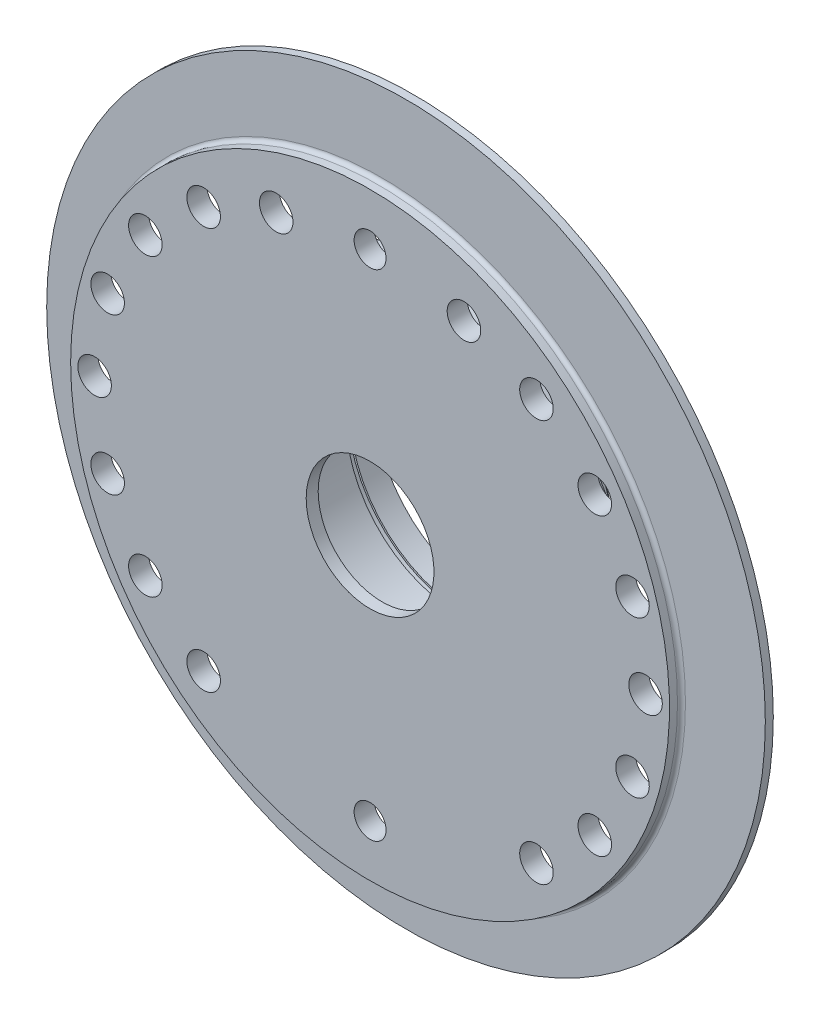
ISO-10303-21;
HEADER;
FILE_DESCRIPTION(('STEP AP214'),'2;1');
FILE_NAME('part.step','',(''),(''),'','','');
FILE_SCHEMA(('AUTOMOTIVE_DESIGN { 1 0 10303 214 1 1 1 1 }'));
ENDSEC;
DATA;
#1=APPLICATION_CONTEXT('core data for automotive mechanical design processes');
#2=APPLICATION_PROTOCOL_DEFINITION('international standard','automotive_design',2000,#1);
#3=PRODUCT_CONTEXT('',#1,'mechanical');
#4=PRODUCT('Part','Part','',(#3));
#5=PRODUCT_RELATED_PRODUCT_CATEGORY('part','',(#4));
#6=PRODUCT_DEFINITION_FORMATION('','',#4);
#7=PRODUCT_DEFINITION_CONTEXT('part definition',#1,'design');
#8=PRODUCT_DEFINITION('design','',#6,#7);
#9=PRODUCT_DEFINITION_SHAPE('','',#8);
#10=(LENGTH_UNIT() NAMED_UNIT(*) SI_UNIT(.MILLI.,.METRE.));
#11=(NAMED_UNIT(*) PLANE_ANGLE_UNIT() SI_UNIT($,.RADIAN.));
#12=(NAMED_UNIT(*) SI_UNIT($,.STERADIAN.) SOLID_ANGLE_UNIT());
#13=UNCERTAINTY_MEASURE_WITH_UNIT(LENGTH_MEASURE(1.E-05),#10,'distance_accuracy_value','');
#14=(GEOMETRIC_REPRESENTATION_CONTEXT(3) GLOBAL_UNCERTAINTY_ASSIGNED_CONTEXT((#13)) GLOBAL_UNIT_ASSIGNED_CONTEXT((#10,
#11,#12)) REPRESENTATION_CONTEXT('',''));
#15=CARTESIAN_POINT('',(0.,0.,0.));
#16=DIRECTION('',(0.,0.,1.));
#17=DIRECTION('',(1.,0.,0.));
#18=AXIS2_PLACEMENT_3D('',#15,#16,#17);
#19=CARTESIAN_POINT('',(0.,14.5,-10.5));
#20=DIRECTION('',(0.,0.,-1.));
#21=DIRECTION('',(-1.,0.,0.));
#22=AXIS2_PLACEMENT_3D('',#19,#20,#21);
#23=PLANE('',#22);
#24=CARTESIAN_POINT('',(0.,0.,-10.5));
#25=DIRECTION('',(0.,0.,-1.));
#26=DIRECTION('',(-1.,0.,0.));
#27=AXIS2_PLACEMENT_3D('',#24,#25,#26);
#28=CIRCLE('',#27,14.75);
#29=CARTESIAN_POINT('',(-14.75,0.,-10.5));
#30=VERTEX_POINT('',#29);
#31=EDGE_CURVE('E96',#30,#30,#28,.T.);
#32=ORIENTED_EDGE('',*,*,#31,.F.);
#33=EDGE_LOOP('',(#32));
#34=FACE_BOUND('',#33,.T.);
#35=CARTESIAN_POINT('',(0.,0.,-10.5));
#36=DIRECTION('',(0.,0.,-1.));
#37=DIRECTION('',(-1.,0.,0.));
#38=AXIS2_PLACEMENT_3D('',#35,#36,#37);
#39=CIRCLE('',#38,14.5);
#40=CARTESIAN_POINT('',(-14.5,0.,-10.5));
#41=VERTEX_POINT('',#40);
#42=EDGE_CURVE('E93',#41,#41,#39,.T.);
#43=ORIENTED_EDGE('',*,*,#42,.T.);
#44=EDGE_LOOP('',(#43));
#45=FACE_BOUND('',#44,.T.);
#46=ADVANCED_FACE('F36',(#34,#45),#23,.F.);
#47=CARTESIAN_POINT('',(0.,0.,1.5));
#48=DIRECTION('',(0.,0.,-1.));
#49=DIRECTION('',(-1.,0.,0.));
#50=AXIS2_PLACEMENT_3D('',#47,#48,#49);
#51=CYLINDRICAL_SURFACE('',#50,14.75);
#52=CARTESIAN_POINT('',(0.,0.,-9.5));
#53=DIRECTION('',(0.,0.,-1.));
#54=DIRECTION('',(-1.,0.,0.));
#55=AXIS2_PLACEMENT_3D('',#52,#53,#54);
#56=CIRCLE('',#55,14.75);
#57=CARTESIAN_POINT('',(-14.75,0.,-9.5));
#58=VERTEX_POINT('',#57);
#59=EDGE_CURVE('E99',#58,#58,#56,.T.);
#60=ORIENTED_EDGE('',*,*,#59,.F.);
#61=EDGE_LOOP('',(#60));
#62=FACE_BOUND('',#61,.T.);
#63=ORIENTED_EDGE('',*,*,#31,.T.);
#64=EDGE_LOOP('',(#63));
#65=FACE_BOUND('',#64,.T.);
#66=ADVANCED_FACE('F241',(#62,#65),#51,.F.);
#67=CARTESIAN_POINT('',(0.,0.,1.5));
#68=DIRECTION('',(0.,0.,-1.));
#69=DIRECTION('',(-1.,0.,0.));
#70=AXIS2_PLACEMENT_3D('',#67,#68,#69);
#71=CYLINDRICAL_SURFACE('',#70,14.5);
#72=ORIENTED_EDGE('',*,*,#42,.F.);
#73=EDGE_LOOP('',(#72));
#74=FACE_BOUND('',#73,.T.);
#75=CARTESIAN_POINT('',(0.,0.,-13.5));
#76=DIRECTION('',(0.,0.,-1.));
#77=DIRECTION('',(-1.,0.,0.));
#78=AXIS2_PLACEMENT_3D('',#75,#76,#77);
#79=CIRCLE('',#78,14.5);
#80=CARTESIAN_POINT('',(-14.5,0.,-13.5));
#81=VERTEX_POINT('',#80);
#82=EDGE_CURVE('E90',#81,#81,#79,.T.);
#83=ORIENTED_EDGE('',*,*,#82,.T.);
#84=EDGE_LOOP('',(#83));
#85=FACE_BOUND('',#84,.T.);
#86=ADVANCED_FACE('F247',(#74,#85),#71,.F.);
#87=CARTESIAN_POINT('',(0.,14.75,-9.5));
#88=DIRECTION('',(0.,0.,1.));
#89=DIRECTION('',(1.,0.,0.));
#90=AXIS2_PLACEMENT_3D('',#87,#88,#89);
#91=PLANE('',#90);
#92=CARTESIAN_POINT('',(0.,0.,-9.5));
#93=DIRECTION('',(0.,0.,-1.));
#94=DIRECTION('',(-1.,0.,0.));
#95=AXIS2_PLACEMENT_3D('',#92,#93,#94);
#96=CIRCLE('',#95,14.);
#97=CARTESIAN_POINT('',(-14.,0.,-9.5));
#98=VERTEX_POINT('',#97);
#99=EDGE_CURVE('E102',#98,#98,#96,.T.);
#100=ORIENTED_EDGE('',*,*,#99,.F.);
#101=EDGE_LOOP('',(#100));
#102=FACE_BOUND('',#101,.T.);
#103=ORIENTED_EDGE('',*,*,#59,.T.);
#104=EDGE_LOOP('',(#103));
#105=FACE_BOUND('',#104,.T.);
#106=ADVANCED_FACE('F256',(#102,#105),#91,.F.);
#107=CARTESIAN_POINT('',(0.,16.,-13.5));
#108=DIRECTION('',(0.,0.,1.));
#109=DIRECTION('',(1.,0.,0.));
#110=AXIS2_PLACEMENT_3D('',#107,#108,#109);
#111=PLANE('',#110);
#112=CARTESIAN_POINT('',(0.,0.,-13.5));
#113=DIRECTION('',(0.,0.,1.));
#114=DIRECTION('',(1.,0.,0.));
#115=AXIS2_PLACEMENT_3D('',#112,#113,#114);
#116=CIRCLE('',#115,15.5);
#117=CARTESIAN_POINT('',(15.5,0.,-13.5));
#118=VERTEX_POINT('',#117);
#119=EDGE_CURVE('E51',#118,#118,#116,.F.);
#120=ORIENTED_EDGE('',*,*,#119,.T.);
#121=EDGE_LOOP('',(#120));
#122=FACE_BOUND('',#121,.T.);
#123=ORIENTED_EDGE('',*,*,#82,.F.);
#124=EDGE_LOOP('',(#123));
#125=FACE_BOUND('',#124,.T.);
#126=ADVANCED_FACE('F258',(#122,#125),#111,.F.);
#127=CARTESIAN_POINT('',(0.,0.,1.5));
#128=DIRECTION('',(0.,0.,-1.));
#129=DIRECTION('',(-1.,0.,0.));
#130=AXIS2_PLACEMENT_3D('',#127,#128,#129);
#131=CYLINDRICAL_SURFACE('',#130,14.);
#132=CARTESIAN_POINT('',(0.,0.,-0.5));
#133=DIRECTION('',(0.,0.,-1.));
#134=DIRECTION('',(-1.,0.,0.));
#135=AXIS2_PLACEMENT_3D('',#132,#133,#134);
#136=CIRCLE('',#135,14.);
#137=CARTESIAN_POINT('',(-14.,0.,-0.499999999999999));
#138=VERTEX_POINT('',#137);
#139=EDGE_CURVE('E105',#138,#138,#136,.T.);
#140=ORIENTED_EDGE('',*,*,#139,.F.);
#141=EDGE_LOOP('',(#140));
#142=FACE_BOUND('',#141,.T.);
#143=ORIENTED_EDGE('',*,*,#99,.T.);
#144=EDGE_LOOP('',(#143));
#145=FACE_BOUND('',#144,.T.);
#146=ADVANCED_FACE('F261',(#142,#145),#131,.F.);
#147=CARTESIAN_POINT('',(0.,0.,-13.5));
#148=DIRECTION('',(0.,0.,1.));
#149=DIRECTION('',(1.,0.,0.));
#150=AXIS2_PLACEMENT_3D('',#147,#148,#149);
#151=CONICAL_SURFACE('',#150,15.5,0.785398163397445);
#152=CARTESIAN_POINT('',(0.,0.,-13.));
#153=DIRECTION('',(0.,0.,1.));
#154=DIRECTION('',(1.,0.,0.));
#155=AXIS2_PLACEMENT_3D('',#152,#153,#154);
#156=CIRCLE('',#155,16.);
#157=CARTESIAN_POINT('',(16.,0.,-13.));
#158=VERTEX_POINT('',#157);
#159=EDGE_CURVE('E47',#158,#158,#156,.T.);
#160=ORIENTED_EDGE('',*,*,#159,.F.);
#161=EDGE_LOOP('',(#160));
#162=FACE_BOUND('',#161,.T.);
#163=ORIENTED_EDGE('',*,*,#119,.F.);
#164=EDGE_LOOP('',(#163));
#165=FACE_BOUND('',#164,.T.);
#166=ADVANCED_FACE('F327',(#162,#165),#151,.T.);
#167=CARTESIAN_POINT('',(0.,14.,-0.5));
#168=DIRECTION('',(0.,0.,1.));
#169=DIRECTION('',(1.,0.,0.));
#170=AXIS2_PLACEMENT_3D('',#167,#168,#169);
#171=PLANE('',#170);
#172=CARTESIAN_POINT('',(0.,0.,-0.5));
#173=DIRECTION('',(0.,0.,-1.));
#174=DIRECTION('',(-1.,0.,0.));
#175=AXIS2_PLACEMENT_3D('',#172,#173,#174);
#176=CIRCLE('',#175,11.5);
#177=CARTESIAN_POINT('',(-11.5,0.,-0.499999999999999));
#178=VERTEX_POINT('',#177);
#179=EDGE_CURVE('E108',#178,#178,#176,.T.);
#180=ORIENTED_EDGE('',*,*,#179,.F.);
#181=EDGE_LOOP('',(#180));
#182=FACE_BOUND('',#181,.T.);
#183=ORIENTED_EDGE('',*,*,#139,.T.);
#184=EDGE_LOOP('',(#183));
#185=FACE_BOUND('',#184,.T.);
#186=ADVANCED_FACE('F267',(#182,#185),#171,.F.);
#187=CARTESIAN_POINT('',(0.,0.,1.5));
#188=DIRECTION('',(0.,0.,-1.));
#189=DIRECTION('',(-1.,0.,0.));
#190=AXIS2_PLACEMENT_3D('',#187,#188,#189);
#191=CYLINDRICAL_SURFACE('',#190,16.);
#192=ORIENTED_EDGE('',*,*,#159,.T.);
#193=EDGE_LOOP('',(#192));
#194=FACE_BOUND('',#193,.T.);
#195=CARTESIAN_POINT('',(0.,0.,-1.5));
#196=DIRECTION('',(0.,0.,-1.));
#197=DIRECTION('',(-1.,0.,0.));
#198=AXIS2_PLACEMENT_3D('',#195,#196,#197);
#199=CIRCLE('',#198,16.);
#200=CARTESIAN_POINT('',(-16.,0.,-1.5));
#201=VERTEX_POINT('',#200);
#202=EDGE_CURVE('E87',#201,#201,#199,.T.);
#203=ORIENTED_EDGE('',*,*,#202,.T.);
#204=EDGE_LOOP('',(#203));
#205=FACE_BOUND('',#204,.T.);
#206=ADVANCED_FACE('F263',(#194,#205),#191,.T.);
#207=CARTESIAN_POINT('',(0.,0.,1.5));
#208=DIRECTION('',(0.,0.,-1.));
#209=DIRECTION('',(-1.,0.,0.));
#210=AXIS2_PLACEMENT_3D('',#207,#208,#209);
#211=CYLINDRICAL_SURFACE('',#210,11.5);
#212=CARTESIAN_POINT('',(0.,0.,0.));
#213=DIRECTION('',(0.,0.,-1.));
#214=DIRECTION('',(-1.,0.,0.));
#215=AXIS2_PLACEMENT_3D('',#212,#213,#214);
#216=CIRCLE('',#215,11.5);
#217=CARTESIAN_POINT('',(-11.5,0.,0.));
#218=VERTEX_POINT('',#217);
#219=EDGE_CURVE('E111',#218,#218,#216,.T.);
#220=ORIENTED_EDGE('',*,*,#219,.F.);
#221=EDGE_LOOP('',(#220));
#222=FACE_BOUND('',#221,.T.);
#223=ORIENTED_EDGE('',*,*,#179,.T.);
#224=EDGE_LOOP('',(#223));
#225=FACE_BOUND('',#224,.T.);
#226=ADVANCED_FACE('F266',(#222,#225),#211,.F.);
#227=CARTESIAN_POINT('',(0.,25.,-1.5));
#228=DIRECTION('',(0.,0.,1.));
#229=DIRECTION('',(1.,0.,0.));
#230=AXIS2_PLACEMENT_3D('',#227,#228,#229);
#231=PLANE('',#230);
#232=ORIENTED_EDGE('',*,*,#202,.F.);
#233=EDGE_LOOP('',(#232));
#234=FACE_BOUND('',#233,.T.);
#235=CARTESIAN_POINT('',(0.,0.,-1.5));
#236=DIRECTION('',(0.,0.,-1.));
#237=DIRECTION('',(-1.,0.,0.));
#238=AXIS2_PLACEMENT_3D('',#235,#236,#237);
#239=CIRCLE('',#238,25.);
#240=CARTESIAN_POINT('',(-25.,0.,-1.5));
#241=VERTEX_POINT('',#240);
#242=EDGE_CURVE('E84',#241,#241,#239,.T.);
#243=ORIENTED_EDGE('',*,*,#242,.T.);
#244=EDGE_LOOP('',(#243));
#245=FACE_BOUND('',#244,.T.);
#246=ADVANCED_FACE('F269',(#234,#245),#231,.F.);
#247=CARTESIAN_POINT('',(0.,11.5,0.));
#248=DIRECTION('',(0.,0.,1.));
#249=DIRECTION('',(1.,0.,0.));
#250=AXIS2_PLACEMENT_3D('',#247,#248,#249);
#251=PLANE('',#250);
#252=CARTESIAN_POINT('',(0.,0.,0.));
#253=DIRECTION('',(0.,0.,-1.));
#254=DIRECTION('',(-1.,0.,0.));
#255=AXIS2_PLACEMENT_3D('',#252,#253,#254);
#256=CIRCLE('',#255,8.);
#257=CARTESIAN_POINT('',(-8.,0.,0.));
#258=VERTEX_POINT('',#257);
#259=EDGE_CURVE('E114',#258,#258,#256,.T.);
#260=ORIENTED_EDGE('',*,*,#259,.F.);
#261=EDGE_LOOP('',(#260));
#262=FACE_BOUND('',#261,.T.);
#263=ORIENTED_EDGE('',*,*,#219,.T.);
#264=EDGE_LOOP('',(#263));
#265=FACE_BOUND('',#264,.T.);
#266=ADVANCED_FACE('F272',(#262,#265),#251,.F.);
#267=CARTESIAN_POINT('',(0.,0.,1.5));
#268=DIRECTION('',(0.,0.,-1.));
#269=DIRECTION('',(-1.,0.,0.));
#270=AXIS2_PLACEMENT_3D('',#267,#268,#269);
#271=CYLINDRICAL_SURFACE('',#270,25.);
#272=ORIENTED_EDGE('',*,*,#242,.F.);
#273=EDGE_LOOP('',(#272));
#274=FACE_BOUND('',#273,.T.);
#275=CARTESIAN_POINT('',(0.,0.,-4.5));
#276=DIRECTION('',(0.,0.,-1.));
#277=DIRECTION('',(-1.,0.,0.));
#278=AXIS2_PLACEMENT_3D('',#275,#276,#277);
#279=CIRCLE('',#278,25.);
#280=CARTESIAN_POINT('',(-25.,0.,-4.5));
#281=VERTEX_POINT('',#280);
#282=EDGE_CURVE('E81',#281,#281,#279,.T.);
#283=ORIENTED_EDGE('',*,*,#282,.T.);
#284=EDGE_LOOP('',(#283));
#285=FACE_BOUND('',#284,.T.);
#286=ADVANCED_FACE('F274',(#274,#285),#271,.F.);
#287=CARTESIAN_POINT('',(0.,0.,1.5));
#288=DIRECTION('',(0.,0.,-1.));
#289=DIRECTION('',(-1.,0.,0.));
#290=AXIS2_PLACEMENT_3D('',#287,#288,#289);
#291=CYLINDRICAL_SURFACE('',#290,8.);
#292=CARTESIAN_POINT('',(0.,0.,1.5));
#293=DIRECTION('',(0.,0.,-1.));
#294=DIRECTION('',(-1.,0.,0.));
#295=AXIS2_PLACEMENT_3D('',#292,#293,#294);
#296=CIRCLE('',#295,8.);
#297=CARTESIAN_POINT('',(-8.,0.,1.5));
#298=VERTEX_POINT('',#297);
#299=EDGE_CURVE('E117',#298,#298,#296,.T.);
#300=ORIENTED_EDGE('',*,*,#299,.F.);
#301=EDGE_LOOP('',(#300));
#302=FACE_BOUND('',#301,.T.);
#303=ORIENTED_EDGE('',*,*,#259,.T.);
#304=EDGE_LOOP('',(#303));
#305=FACE_BOUND('',#304,.T.);
#306=ADVANCED_FACE('F277',(#302,#305),#291,.F.);
#307=CARTESIAN_POINT('',(0.,27.,-4.5));
#308=DIRECTION('',(0.,0.,1.));
#309=DIRECTION('',(1.,0.,0.));
#310=AXIS2_PLACEMENT_3D('',#307,#308,#309);
#311=PLANE('',#310);
#312=ORIENTED_EDGE('',*,*,#282,.F.);
#313=EDGE_LOOP('',(#312));
#314=FACE_BOUND('',#313,.T.);
#315=CARTESIAN_POINT('',(0.,0.,-4.5));
#316=DIRECTION('',(0.,0.,-1.));
#317=DIRECTION('',(-1.,0.,0.));
#318=AXIS2_PLACEMENT_3D('',#315,#316,#317);
#319=CIRCLE('',#318,27.);
#320=CARTESIAN_POINT('',(-27.,0.,-4.5));
#321=VERTEX_POINT('',#320);
#322=EDGE_CURVE('E78',#321,#321,#319,.T.);
#323=ORIENTED_EDGE('',*,*,#322,.T.);
#324=EDGE_LOOP('',(#323));
#325=FACE_BOUND('',#324,.T.);
#326=ADVANCED_FACE('F279',(#314,#325),#311,.F.);
#327=CARTESIAN_POINT('',(0.,8.,1.5));
#328=DIRECTION('',(0.,0.,-1.));
#329=DIRECTION('',(-1.,0.,0.));
#330=AXIS2_PLACEMENT_3D('',#327,#328,#329);
#331=PLANE('',#330);
#332=CARTESIAN_POINT('',(0.,-31.,1.5));
#333=DIRECTION('',(0.,0.,1.));
#334=DIRECTION('',(1.,0.,0.));
#335=AXIS2_PLACEMENT_3D('',#332,#333,#334);
#336=CIRCLE('',#335,2.);
#337=CARTESIAN_POINT('',(1.99999999999999,-31.,1.5));
#338=VERTEX_POINT('',#337);
#339=EDGE_CURVE('E209',#338,#338,#336,.T.);
#340=ORIENTED_EDGE('',*,*,#339,.F.);
#341=EDGE_LOOP('',(#340));
#342=FACE_BOUND('',#341,.T.);
#343=CARTESIAN_POINT('',(0.,31.,1.5));
#344=DIRECTION('',(0.,0.,1.));
#345=DIRECTION('',(1.,0.,0.));
#346=AXIS2_PLACEMENT_3D('',#343,#344,#345);
#347=CIRCLE('',#346,2.);
#348=CARTESIAN_POINT('',(2.00000000000001,31.,1.5));
#349=VERTEX_POINT('',#348);
#350=EDGE_CURVE('E203',#349,#349,#347,.T.);
#351=ORIENTED_EDGE('',*,*,#350,.F.);
#352=EDGE_LOOP('',(#351));
#353=FACE_BOUND('',#352,.T.);
#354=CARTESIAN_POINT('',(20.8391710504507,-25.1601170383628,1.5));
#355=DIRECTION('',(0.,0.,1.));
#356=DIRECTION('',(0.544639035015025,-0.838670567945425,0.));
#357=AXIS2_PLACEMENT_3D('',#354,#355,#356);
#358=CIRCLE('',#357,2.1);
#359=CARTESIAN_POINT('',(21.9829130239823,-26.9213252310482,1.5));
#360=VERTEX_POINT('',#359);
#361=EDGE_CURVE('E197',#360,#360,#358,.T.);
#362=ORIENTED_EDGE('',*,*,#361,.F.);
#363=EDGE_LOOP('',(#362));
#364=FACE_BOUND('',#363,.T.);
#365=CARTESIAN_POINT('',(28.1403226082016,-18.4698442597698,1.5));
#366=DIRECTION('',(0.,0.,1.));
#367=DIRECTION('',(0.788010753606721,-0.61566147532566,0.));
#368=AXIS2_PLACEMENT_3D('',#365,#366,#367);
#369=CIRCLE('',#368,2.1);
#370=CARTESIAN_POINT('',(29.7951451907757,-19.7627333579537,1.5));
#371=VERTEX_POINT('',#370);
#372=EDGE_CURVE('E191',#371,#371,#369,.T.);
#373=ORIENTED_EDGE('',*,*,#372,.F.);
#374=EDGE_LOOP('',(#373));
#375=FACE_BOUND('',#374,.T.);
#376=CARTESIAN_POINT('',(32.8655572679795,-9.76704463371473,1.5));
#377=DIRECTION('',(0.,0.,1.));
#378=DIRECTION('',(0.945518575599317,-0.325568154457158,0.));
#379=AXIS2_PLACEMENT_3D('',#376,#377,#378);
#380=CIRCLE('',#379,2.1);
#381=CARTESIAN_POINT('',(34.851146276738,-10.4507377580748,1.5));
#382=VERTEX_POINT('',#381);
#383=EDGE_CURVE('E185',#382,#382,#380,.T.);
#384=ORIENTED_EDGE('',*,*,#383,.F.);
#385=EDGE_LOOP('',(#384));
#386=FACE_BOUND('',#385,.T.);
#387=CARTESIAN_POINT('',(11.75765686799,29.1088717882799,1.5));
#388=DIRECTION('',(0.,0.,1.));
#389=DIRECTION('',(0.241921895599665,0.970295726275997,0.));
#390=AXIS2_PLACEMENT_3D('',#387,#388,#389);
#391=CIRCLE('',#390,2.1);
#392=CARTESIAN_POINT('',(12.2656928487492,31.1464928134595,1.5));
#393=VERTEX_POINT('',#392);
#394=EDGE_CURVE('E179',#393,#393,#391,.T.);
#395=ORIENTED_EDGE('',*,*,#394,.F.);
#396=EDGE_LOOP('',(#395));
#397=FACE_BOUND('',#396,.T.);
#398=CARTESIAN_POINT('',(20.8391710504508,25.1601170383628,1.5));
#399=DIRECTION('',(0.,0.,1.));
#400=DIRECTION('',(0.544639035015025,0.838670567945425,0.));
#401=AXIS2_PLACEMENT_3D('',#398,#399,#400);
#402=CIRCLE('',#401,2.1);
#403=CARTESIAN_POINT('',(21.9829130239823,26.9213252310481,1.5));
#404=VERTEX_POINT('',#403);
#405=EDGE_CURVE('E173',#404,#404,#402,.T.);
#406=ORIENTED_EDGE('',*,*,#405,.F.);
#407=EDGE_LOOP('',(#406));
#408=FACE_BOUND('',#407,.T.);
#409=CARTESIAN_POINT('',(28.1403226082016,18.4698442597698,1.5));
#410=DIRECTION('',(0.,0.,1.));
#411=DIRECTION('',(0.788010753606721,0.615661475325659,0.));
#412=AXIS2_PLACEMENT_3D('',#409,#410,#411);
#413=CIRCLE('',#412,2.1);
#414=CARTESIAN_POINT('',(29.7951451907758,19.7627333579537,1.5));
#415=VERTEX_POINT('',#414);
#416=EDGE_CURVE('E167',#415,#415,#413,.T.);
#417=ORIENTED_EDGE('',*,*,#416,.F.);
#418=EDGE_LOOP('',(#417));
#419=FACE_BOUND('',#418,.T.);
#420=CARTESIAN_POINT('',(32.8655572679795,9.76704463371471,1.5));
#421=DIRECTION('',(0.,0.,1.));
#422=DIRECTION('',(0.945518575599317,0.325568154457157,0.));
#423=AXIS2_PLACEMENT_3D('',#420,#421,#422);
#424=CIRCLE('',#423,2.1);
#425=CARTESIAN_POINT('',(34.851146276738,10.4507377580747,1.5));
#426=VERTEX_POINT('',#425);
#427=EDGE_CURVE('E61',#426,#426,#424,.T.);
#428=ORIENTED_EDGE('',*,*,#427,.F.);
#429=EDGE_LOOP('',(#428));
#430=FACE_BOUND('',#429,.T.);
#431=CARTESIAN_POINT('',(34.5,0.,1.5));
#432=DIRECTION('',(0.,0.,1.));
#433=DIRECTION('',(1.,0.,0.));
#434=AXIS2_PLACEMENT_3D('',#431,#432,#433);
#435=CIRCLE('',#434,2.1);
#436=CARTESIAN_POINT('',(36.6,0.,1.5));
#437=VERTEX_POINT('',#436);
#438=EDGE_CURVE('E60',#437,#437,#435,.T.);
#439=ORIENTED_EDGE('',*,*,#438,.F.);
#440=EDGE_LOOP('',(#439));
#441=FACE_BOUND('',#440,.T.);
#442=CARTESIAN_POINT('',(-11.7576568679899,29.1088717882799,1.5));
#443=DIRECTION('',(0.,0.,1.));
#444=DIRECTION('',(0.241921895599665,-0.970295726275997,0.));
#445=AXIS2_PLACEMENT_3D('',#442,#443,#444);
#446=CIRCLE('',#445,2.1);
#447=CARTESIAN_POINT('',(-11.2496208872306,27.0712507631003,1.5));
#448=VERTEX_POINT('',#447);
#449=EDGE_CURVE('E65',#448,#448,#446,.T.);
#450=ORIENTED_EDGE('',*,*,#449,.F.);
#451=EDGE_LOOP('',(#450));
#452=FACE_BOUND('',#451,.T.);
#453=CARTESIAN_POINT('',(-20.8391710504508,25.1601170383628,1.5));
#454=DIRECTION('',(0.,0.,1.));
#455=DIRECTION('',(0.544639035015025,-0.838670567945425,0.));
#456=AXIS2_PLACEMENT_3D('',#453,#454,#455);
#457=CIRCLE('',#456,2.1);
#458=CARTESIAN_POINT('',(-19.6954290769192,23.3989088456774,1.5));
#459=VERTEX_POINT('',#458);
#460=EDGE_CURVE('E152',#459,#459,#457,.T.);
#461=ORIENTED_EDGE('',*,*,#460,.F.);
#462=EDGE_LOOP('',(#461));
#463=FACE_BOUND('',#462,.T.);
#464=CARTESIAN_POINT('',(-28.1403226082016,18.4698442597698,1.5));
#465=DIRECTION('',(0.,0.,1.));
#466=DIRECTION('',(0.788010753606721,-0.61566147532566,0.));
#467=AXIS2_PLACEMENT_3D('',#464,#465,#466);
#468=CIRCLE('',#467,2.1);
#469=CARTESIAN_POINT('',(-26.4855000256275,17.1769551615859,1.5));
#470=VERTEX_POINT('',#469);
#471=EDGE_CURVE('E146',#470,#470,#468,.T.);
#472=ORIENTED_EDGE('',*,*,#471,.F.);
#473=EDGE_LOOP('',(#472));
#474=FACE_BOUND('',#473,.T.);
#475=CARTESIAN_POINT('',(-32.8655572679795,9.76704463371473,1.5));
#476=DIRECTION('',(0.,0.,1.));
#477=DIRECTION('',(0.945518575599317,-0.325568154457158,0.));
#478=AXIS2_PLACEMENT_3D('',#475,#476,#477);
#479=CIRCLE('',#478,2.1);
#480=CARTESIAN_POINT('',(-30.8799682592209,9.0833515093547,1.5));
#481=VERTEX_POINT('',#480);
#482=EDGE_CURVE('E70',#481,#481,#479,.T.);
#483=ORIENTED_EDGE('',*,*,#482,.F.);
#484=EDGE_LOOP('',(#483));
#485=FACE_BOUND('',#484,.T.);
#486=CARTESIAN_POINT('',(-20.8391710504508,-25.1601170383628,1.5));
#487=DIRECTION('',(0.,0.,1.));
#488=DIRECTION('',(0.544639035015025,0.838670567945425,0.));
#489=AXIS2_PLACEMENT_3D('',#486,#487,#488);
#490=CIRCLE('',#489,2.1);
#491=CARTESIAN_POINT('',(-19.6954290769192,-23.3989088456774,1.5));
#492=VERTEX_POINT('',#491);
#493=EDGE_CURVE('E69',#492,#492,#490,.T.);
#494=ORIENTED_EDGE('',*,*,#493,.F.);
#495=EDGE_LOOP('',(#494));
#496=FACE_BOUND('',#495,.T.);
#497=CARTESIAN_POINT('',(-28.1403226082016,-18.4698442597698,1.5));
#498=DIRECTION('',(0.,0.,1.));
#499=DIRECTION('',(0.788010753606721,0.615661475325659,0.));
#500=AXIS2_PLACEMENT_3D('',#497,#498,#499);
#501=CIRCLE('',#500,2.1);
#502=CARTESIAN_POINT('',(-26.4855000256275,-17.1769551615859,1.5));
#503=VERTEX_POINT('',#502);
#504=EDGE_CURVE('E133',#503,#503,#501,.T.);
#505=ORIENTED_EDGE('',*,*,#504,.F.);
#506=EDGE_LOOP('',(#505));
#507=FACE_BOUND('',#506,.T.);
#508=CARTESIAN_POINT('',(-32.8655572679795,-9.76704463371471,1.5));
#509=DIRECTION('',(0.,0.,1.));
#510=DIRECTION('',(0.945518575599317,0.325568154457157,0.));
#511=AXIS2_PLACEMENT_3D('',#508,#509,#510);
#512=CIRCLE('',#511,2.1);
#513=CARTESIAN_POINT('',(-30.8799682592209,-9.08335150935469,1.5));
#514=VERTEX_POINT('',#513);
#515=EDGE_CURVE('E127',#514,#514,#512,.T.);
#516=ORIENTED_EDGE('',*,*,#515,.F.);
#517=EDGE_LOOP('',(#516));
#518=FACE_BOUND('',#517,.T.);
#519=CARTESIAN_POINT('',(-34.5,0.,1.5));
#520=DIRECTION('',(0.,0.,1.));
#521=DIRECTION('',(1.,0.,0.));
#522=AXIS2_PLACEMENT_3D('',#519,#520,#521);
#523=CIRCLE('',#522,2.1);
#524=CARTESIAN_POINT('',(-32.4,0.,1.5));
#525=VERTEX_POINT('',#524);
#526=EDGE_CURVE('E75',#525,#525,#523,.T.);
#527=ORIENTED_EDGE('',*,*,#526,.F.);
#528=EDGE_LOOP('',(#527));
#529=FACE_BOUND('',#528,.T.);
#530=CARTESIAN_POINT('',(0.,0.,1.5));
#531=DIRECTION('',(0.,0.,-1.));
#532=DIRECTION('',(-1.,0.,0.));
#533=AXIS2_PLACEMENT_3D('',#530,#531,#532);
#534=CIRCLE('',#533,37.5);
#535=CARTESIAN_POINT('',(-37.5,0.,1.5));
#536=VERTEX_POINT('',#535);
#537=EDGE_CURVE('E74',#536,#536,#534,.T.);
#538=ORIENTED_EDGE('',*,*,#537,.F.);
#539=EDGE_LOOP('',(#538));
#540=FACE_BOUND('',#539,.T.);
#541=ORIENTED_EDGE('',*,*,#299,.T.);
#542=EDGE_LOOP('',(#541));
#543=FACE_BOUND('',#542,.T.);
#544=ADVANCED_FACE('F281',(#342,#353,#364,#375,#386,#397,#408,#419,#430,#441,#452,#463,#474,
#485,#496,#507,#518,#529,#540,#543),#331,.F.);
#545=CARTESIAN_POINT('',(0.,0.,1.5));
#546=DIRECTION('',(0.,0.,-1.));
#547=DIRECTION('',(-1.,0.,0.));
#548=AXIS2_PLACEMENT_3D('',#545,#546,#547);
#549=CYLINDRICAL_SURFACE('',#548,37.5);
#550=CARTESIAN_POINT('',(0.,0.,0.499999999999999));
#551=DIRECTION('',(0.,0.,1.));
#552=DIRECTION('',(1.,0.,0.));
#553=AXIS2_PLACEMENT_3D('',#550,#551,#552);
#554=CIRCLE('',#553,37.5);
#555=CARTESIAN_POINT('',(37.5,0.,0.499999999999999));
#556=VERTEX_POINT('',#555);
#557=EDGE_CURVE('E43',#556,#556,#554,.T.);
#558=ORIENTED_EDGE('',*,*,#557,.T.);
#559=EDGE_LOOP('',(#558));
#560=FACE_BOUND('',#559,.T.);
#561=ORIENTED_EDGE('',*,*,#537,.T.);
#562=EDGE_LOOP('',(#561));
#563=FACE_BOUND('',#562,.T.);
#564=ADVANCED_FACE('F38',(#560,#563),#549,.T.);
#565=CARTESIAN_POINT('',(0.,0.,1.5));
#566=DIRECTION('',(0.,0.,-1.));
#567=DIRECTION('',(-1.,0.,0.));
#568=AXIS2_PLACEMENT_3D('',#565,#566,#567);
#569=CYLINDRICAL_SURFACE('',#568,27.);
#570=ORIENTED_EDGE('',*,*,#322,.F.);
#571=EDGE_LOOP('',(#570));
#572=FACE_BOUND('',#571,.T.);
#573=CARTESIAN_POINT('',(0.,0.,-0.999999999999998));
#574=DIRECTION('',(0.,0.,-1.));
#575=DIRECTION('',(-1.,0.,0.));
#576=AXIS2_PLACEMENT_3D('',#573,#574,#575);
#577=CIRCLE('',#576,27.);
#578=CARTESIAN_POINT('',(-27.,0.,-0.999999999999997));
#579=VERTEX_POINT('',#578);
#580=EDGE_CURVE('E56',#579,#579,#577,.T.);
#581=ORIENTED_EDGE('',*,*,#580,.T.);
#582=EDGE_LOOP('',(#581));
#583=FACE_BOUND('',#582,.T.);
#584=ADVANCED_FACE('F283',(#572,#583),#569,.T.);
#585=CARTESIAN_POINT('',(-34.5,0.,-8.5));
#586=DIRECTION('',(0.,0.,1.));
#587=DIRECTION('',(1.,0.,0.));
#588=AXIS2_PLACEMENT_3D('',#585,#586,#587);
#589=CYLINDRICAL_SURFACE('',#588,2.1);
#590=ORIENTED_EDGE('',*,*,#526,.T.);
#591=EDGE_LOOP('',(#590));
#592=FACE_BOUND('',#591,.T.);
#593=CARTESIAN_POINT('',(-34.5,0.,-0.999999999999996));
#594=DIRECTION('',(0.,0.,1.));
#595=DIRECTION('',(1.,0.,0.));
#596=AXIS2_PLACEMENT_3D('',#593,#594,#595);
#597=CIRCLE('',#596,2.1);
#598=CARTESIAN_POINT('',(-32.4,0.,-0.999999999999996));
#599=VERTEX_POINT('',#598);
#600=EDGE_CURVE('E71',#599,#599,#597,.T.);
#601=ORIENTED_EDGE('',*,*,#600,.F.);
#602=EDGE_LOOP('',(#601));
#603=FACE_BOUND('',#602,.T.);
#604=ADVANCED_FACE('F285',(#592,#603),#589,.F.);
#605=CARTESIAN_POINT('',(-32.8655572679795,-9.76704463371471,-8.5));
#606=DIRECTION('',(0.,0.,1.));
#607=DIRECTION('',(1.,0.,0.));
#608=AXIS2_PLACEMENT_3D('',#605,#606,#607);
#609=CYLINDRICAL_SURFACE('',#608,2.1);
#610=ORIENTED_EDGE('',*,*,#515,.T.);
#611=EDGE_LOOP('',(#610));
#612=FACE_BOUND('',#611,.T.);
#613=CARTESIAN_POINT('',(-32.8655572679795,-9.76704463371471,-0.999999999999995));
#614=DIRECTION('',(0.,0.,1.));
#615=DIRECTION('',(1.,0.,0.));
#616=AXIS2_PLACEMENT_3D('',#613,#614,#615);
#617=CIRCLE('',#616,2.1);
#618=CARTESIAN_POINT('',(-30.7655572679795,-9.76704463371471,-0.999999999999995));
#619=VERTEX_POINT('',#618);
#620=EDGE_CURVE('E124',#619,#619,#617,.T.);
#621=ORIENTED_EDGE('',*,*,#620,.F.);
#622=EDGE_LOOP('',(#621));
#623=FACE_BOUND('',#622,.T.);
#624=ADVANCED_FACE('F291',(#612,#623),#609,.F.);
#625=CARTESIAN_POINT('',(-28.1403226082016,-18.4698442597698,-8.49999999999999));
#626=DIRECTION('',(0.,0.,1.));
#627=DIRECTION('',(1.,0.,0.));
#628=AXIS2_PLACEMENT_3D('',#625,#626,#627);
#629=CYLINDRICAL_SURFACE('',#628,2.1);
#630=ORIENTED_EDGE('',*,*,#504,.T.);
#631=EDGE_LOOP('',(#630));
#632=FACE_BOUND('',#631,.T.);
#633=CARTESIAN_POINT('',(-28.1403226082016,-18.4698442597698,-0.999999999999995));
#634=DIRECTION('',(0.,0.,1.));
#635=DIRECTION('',(1.,0.,0.));
#636=AXIS2_PLACEMENT_3D('',#633,#634,#635);
#637=CIRCLE('',#636,2.1);
#638=CARTESIAN_POINT('',(-26.0403226082016,-18.4698442597698,-0.999999999999995));
#639=VERTEX_POINT('',#638);
#640=EDGE_CURVE('E130',#639,#639,#637,.T.);
#641=ORIENTED_EDGE('',*,*,#640,.F.);
#642=EDGE_LOOP('',(#641));
#643=FACE_BOUND('',#642,.T.);
#644=ADVANCED_FACE('F345',(#632,#643),#629,.F.);
#645=CARTESIAN_POINT('',(-20.8391710504508,-25.1601170383628,-8.49999999999999));
#646=DIRECTION('',(0.,0.,1.));
#647=DIRECTION('',(1.,0.,0.));
#648=AXIS2_PLACEMENT_3D('',#645,#646,#647);
#649=CYLINDRICAL_SURFACE('',#648,2.1);
#650=ORIENTED_EDGE('',*,*,#493,.T.);
#651=EDGE_LOOP('',(#650));
#652=FACE_BOUND('',#651,.T.);
#653=CARTESIAN_POINT('',(-20.8391710504508,-25.1601170383628,-0.999999999999995));
#654=DIRECTION('',(0.,0.,1.));
#655=DIRECTION('',(1.,0.,0.));
#656=AXIS2_PLACEMENT_3D('',#653,#654,#655);
#657=CIRCLE('',#656,2.1);
#658=CARTESIAN_POINT('',(-18.7391710504508,-25.1601170383628,-0.999999999999995));
#659=VERTEX_POINT('',#658);
#660=EDGE_CURVE('E136',#659,#659,#657,.T.);
#661=ORIENTED_EDGE('',*,*,#660,.F.);
#662=EDGE_LOOP('',(#661));
#663=FACE_BOUND('',#662,.T.);
#664=ADVANCED_FACE('F349',(#652,#663),#649,.F.);
#665=CARTESIAN_POINT('',(-32.8655572679795,9.76704463371473,-8.5));
#666=DIRECTION('',(0.,0.,1.));
#667=DIRECTION('',(1.,0.,0.));
#668=AXIS2_PLACEMENT_3D('',#665,#666,#667);
#669=CYLINDRICAL_SURFACE('',#668,2.1);
#670=ORIENTED_EDGE('',*,*,#482,.T.);
#671=EDGE_LOOP('',(#670));
#672=FACE_BOUND('',#671,.T.);
#673=CARTESIAN_POINT('',(-32.8655572679795,9.76704463371473,-0.999999999999996));
#674=DIRECTION('',(0.,0.,1.));
#675=DIRECTION('',(1.,0.,0.));
#676=AXIS2_PLACEMENT_3D('',#673,#674,#675);
#677=CIRCLE('',#676,2.1);
#678=CARTESIAN_POINT('',(-30.7655572679795,9.76704463371473,-0.999999999999996));
#679=VERTEX_POINT('',#678);
#680=EDGE_CURVE('E66',#679,#679,#677,.T.);
#681=ORIENTED_EDGE('',*,*,#680,.F.);
#682=EDGE_LOOP('',(#681));
#683=FACE_BOUND('',#682,.T.);
#684=ADVANCED_FACE('F353',(#672,#683),#669,.F.);
#685=CARTESIAN_POINT('',(-28.1403226082016,18.4698442597698,-8.5));
#686=DIRECTION('',(0.,0.,1.));
#687=DIRECTION('',(1.,0.,0.));
#688=AXIS2_PLACEMENT_3D('',#685,#686,#687);
#689=CYLINDRICAL_SURFACE('',#688,2.1);
#690=ORIENTED_EDGE('',*,*,#471,.T.);
#691=EDGE_LOOP('',(#690));
#692=FACE_BOUND('',#691,.T.);
#693=CARTESIAN_POINT('',(-28.1403226082016,18.4698442597698,-0.999999999999997));
#694=DIRECTION('',(0.,0.,1.));
#695=DIRECTION('',(1.,0.,0.));
#696=AXIS2_PLACEMENT_3D('',#693,#694,#695);
#697=CIRCLE('',#696,2.1);
#698=CARTESIAN_POINT('',(-26.0403226082016,18.4698442597698,-0.999999999999997));
#699=VERTEX_POINT('',#698);
#700=EDGE_CURVE('E143',#699,#699,#697,.T.);
#701=ORIENTED_EDGE('',*,*,#700,.F.);
#702=EDGE_LOOP('',(#701));
#703=FACE_BOUND('',#702,.T.);
#704=ADVANCED_FACE('F357',(#692,#703),#689,.F.);
#705=CARTESIAN_POINT('',(-20.8391710504508,25.1601170383628,-8.5));
#706=DIRECTION('',(0.,0.,1.));
#707=DIRECTION('',(1.,0.,0.));
#708=AXIS2_PLACEMENT_3D('',#705,#706,#707);
#709=CYLINDRICAL_SURFACE('',#708,2.1);
#710=ORIENTED_EDGE('',*,*,#460,.T.);
#711=EDGE_LOOP('',(#710));
#712=FACE_BOUND('',#711,.T.);
#713=CARTESIAN_POINT('',(-20.8391710504508,25.1601170383628,-0.999999999999997));
#714=DIRECTION('',(0.,0.,1.));
#715=DIRECTION('',(1.,0.,0.));
#716=AXIS2_PLACEMENT_3D('',#713,#714,#715);
#717=CIRCLE('',#716,2.1);
#718=CARTESIAN_POINT('',(-18.7391710504508,25.1601170383628,-0.999999999999998));
#719=VERTEX_POINT('',#718);
#720=EDGE_CURVE('E149',#719,#719,#717,.T.);
#721=ORIENTED_EDGE('',*,*,#720,.F.);
#722=EDGE_LOOP('',(#721));
#723=FACE_BOUND('',#722,.T.);
#724=ADVANCED_FACE('F361',(#712,#723),#709,.F.);
#725=CARTESIAN_POINT('',(-11.7576568679899,29.1088717882799,-8.5));
#726=DIRECTION('',(0.,0.,1.));
#727=DIRECTION('',(1.,0.,0.));
#728=AXIS2_PLACEMENT_3D('',#725,#726,#727);
#729=CYLINDRICAL_SURFACE('',#728,2.1);
#730=ORIENTED_EDGE('',*,*,#449,.T.);
#731=EDGE_LOOP('',(#730));
#732=FACE_BOUND('',#731,.T.);
#733=CARTESIAN_POINT('',(-11.7576568679899,29.1088717882799,-0.999999999999998));
#734=DIRECTION('',(0.,0.,1.));
#735=DIRECTION('',(1.,0.,0.));
#736=AXIS2_PLACEMENT_3D('',#733,#734,#735);
#737=CIRCLE('',#736,2.1);
#738=CARTESIAN_POINT('',(-9.65765686798994,29.1088717882799,-0.999999999999999));
#739=VERTEX_POINT('',#738);
#740=EDGE_CURVE('E155',#739,#739,#737,.T.);
#741=ORIENTED_EDGE('',*,*,#740,.F.);
#742=EDGE_LOOP('',(#741));
#743=FACE_BOUND('',#742,.T.);
#744=ADVANCED_FACE('F365',(#732,#743),#729,.F.);
#745=CARTESIAN_POINT('',(34.5,0.,-8.5));
#746=DIRECTION('',(0.,0.,1.));
#747=DIRECTION('',(1.,0.,0.));
#748=AXIS2_PLACEMENT_3D('',#745,#746,#747);
#749=CYLINDRICAL_SURFACE('',#748,2.1);
#750=ORIENTED_EDGE('',*,*,#438,.T.);
#751=EDGE_LOOP('',(#750));
#752=FACE_BOUND('',#751,.T.);
#753=CARTESIAN_POINT('',(34.5,0.,-0.999999999999999));
#754=DIRECTION('',(0.,0.,1.));
#755=DIRECTION('',(1.,0.,0.));
#756=AXIS2_PLACEMENT_3D('',#753,#754,#755);
#757=CIRCLE('',#756,2.1);
#758=CARTESIAN_POINT('',(36.6,0.,-0.999999999999999));
#759=VERTEX_POINT('',#758);
#760=EDGE_CURVE('E62',#759,#759,#757,.T.);
#761=ORIENTED_EDGE('',*,*,#760,.F.);
#762=EDGE_LOOP('',(#761));
#763=FACE_BOUND('',#762,.T.);
#764=ADVANCED_FACE('F369',(#752,#763),#749,.F.);
#765=CARTESIAN_POINT('',(32.8655572679795,9.76704463371471,-8.5));
#766=DIRECTION('',(0.,0.,1.));
#767=DIRECTION('',(1.,0.,0.));
#768=AXIS2_PLACEMENT_3D('',#765,#766,#767);
#769=CYLINDRICAL_SURFACE('',#768,2.1);
#770=ORIENTED_EDGE('',*,*,#427,.T.);
#771=EDGE_LOOP('',(#770));
#772=FACE_BOUND('',#771,.T.);
#773=CARTESIAN_POINT('',(32.8655572679795,9.76704463371471,-1.));
#774=DIRECTION('',(0.,0.,1.));
#775=DIRECTION('',(1.,0.,0.));
#776=AXIS2_PLACEMENT_3D('',#773,#774,#775);
#777=CIRCLE('',#776,2.1);
#778=CARTESIAN_POINT('',(34.9655572679795,9.76704463371471,-1.));
#779=VERTEX_POINT('',#778);
#780=EDGE_CURVE('E57',#779,#779,#777,.T.);
#781=ORIENTED_EDGE('',*,*,#780,.F.);
#782=EDGE_LOOP('',(#781));
#783=FACE_BOUND('',#782,.T.);
#784=ADVANCED_FACE('F373',(#772,#783),#769,.F.);
#785=CARTESIAN_POINT('',(28.1403226082016,18.4698442597698,-8.5));
#786=DIRECTION('',(0.,0.,1.));
#787=DIRECTION('',(1.,0.,0.));
#788=AXIS2_PLACEMENT_3D('',#785,#786,#787);
#789=CYLINDRICAL_SURFACE('',#788,2.1);
#790=ORIENTED_EDGE('',*,*,#416,.T.);
#791=EDGE_LOOP('',(#790));
#792=FACE_BOUND('',#791,.T.);
#793=CARTESIAN_POINT('',(28.1403226082016,18.4698442597698,-1.));
#794=DIRECTION('',(0.,0.,1.));
#795=DIRECTION('',(1.,0.,0.));
#796=AXIS2_PLACEMENT_3D('',#793,#794,#795);
#797=CIRCLE('',#796,2.1);
#798=CARTESIAN_POINT('',(30.2403226082016,18.4698442597698,-1.));
#799=VERTEX_POINT('',#798);
#800=EDGE_CURVE('E164',#799,#799,#797,.T.);
#801=ORIENTED_EDGE('',*,*,#800,.F.);
#802=EDGE_LOOP('',(#801));
#803=FACE_BOUND('',#802,.T.);
#804=ADVANCED_FACE('F377',(#792,#803),#789,.F.);
#805=CARTESIAN_POINT('',(20.8391710504508,25.1601170383628,-8.5));
#806=DIRECTION('',(0.,0.,1.));
#807=DIRECTION('',(1.,0.,0.));
#808=AXIS2_PLACEMENT_3D('',#805,#806,#807);
#809=CYLINDRICAL_SURFACE('',#808,2.1);
#810=ORIENTED_EDGE('',*,*,#405,.T.);
#811=EDGE_LOOP('',(#810));
#812=FACE_BOUND('',#811,.T.);
#813=CARTESIAN_POINT('',(20.8391710504508,25.1601170383628,-1.));
#814=DIRECTION('',(0.,0.,1.));
#815=DIRECTION('',(1.,0.,0.));
#816=AXIS2_PLACEMENT_3D('',#813,#814,#815);
#817=CIRCLE('',#816,2.1);
#818=CARTESIAN_POINT('',(22.9391710504508,25.1601170383628,-1.));
#819=VERTEX_POINT('',#818);
#820=EDGE_CURVE('E170',#819,#819,#817,.T.);
#821=ORIENTED_EDGE('',*,*,#820,.F.);
#822=EDGE_LOOP('',(#821));
#823=FACE_BOUND('',#822,.T.);
#824=ADVANCED_FACE('F381',(#812,#823),#809,.F.);
#825=CARTESIAN_POINT('',(11.75765686799,29.1088717882799,-8.5));
#826=DIRECTION('',(0.,0.,1.));
#827=DIRECTION('',(1.,0.,0.));
#828=AXIS2_PLACEMENT_3D('',#825,#826,#827);
#829=CYLINDRICAL_SURFACE('',#828,2.1);
#830=ORIENTED_EDGE('',*,*,#394,.T.);
#831=EDGE_LOOP('',(#830));
#832=FACE_BOUND('',#831,.T.);
#833=CARTESIAN_POINT('',(11.75765686799,29.1088717882799,-1.));
#834=DIRECTION('',(0.,0.,1.));
#835=DIRECTION('',(1.,0.,0.));
#836=AXIS2_PLACEMENT_3D('',#833,#834,#835);
#837=CIRCLE('',#836,2.1);
#838=CARTESIAN_POINT('',(13.85765686799,29.1088717882799,-1.));
#839=VERTEX_POINT('',#838);
#840=EDGE_CURVE('E176',#839,#839,#837,.T.);
#841=ORIENTED_EDGE('',*,*,#840,.F.);
#842=EDGE_LOOP('',(#841));
#843=FACE_BOUND('',#842,.T.);
#844=ADVANCED_FACE('F385',(#832,#843),#829,.F.);
#845=CARTESIAN_POINT('',(32.8655572679795,-9.76704463371473,-8.5));
#846=DIRECTION('',(0.,0.,1.));
#847=DIRECTION('',(1.,0.,0.));
#848=AXIS2_PLACEMENT_3D('',#845,#846,#847);
#849=CYLINDRICAL_SURFACE('',#848,2.1);
#850=ORIENTED_EDGE('',*,*,#383,.T.);
#851=EDGE_LOOP('',(#850));
#852=FACE_BOUND('',#851,.T.);
#853=CARTESIAN_POINT('',(32.8655572679795,-9.76704463371473,-0.999999999999999));
#854=DIRECTION('',(0.,0.,1.));
#855=DIRECTION('',(1.,0.,0.));
#856=AXIS2_PLACEMENT_3D('',#853,#854,#855);
#857=CIRCLE('',#856,2.1);
#858=CARTESIAN_POINT('',(34.9655572679795,-9.76704463371473,-0.999999999999999));
#859=VERTEX_POINT('',#858);
#860=EDGE_CURVE('E182',#859,#859,#857,.T.);
#861=ORIENTED_EDGE('',*,*,#860,.F.);
#862=EDGE_LOOP('',(#861));
#863=FACE_BOUND('',#862,.T.);
#864=ADVANCED_FACE('F389',(#852,#863),#849,.F.);
#865=CARTESIAN_POINT('',(28.1403226082016,-18.4698442597698,-8.5));
#866=DIRECTION('',(0.,0.,1.));
#867=DIRECTION('',(1.,0.,0.));
#868=AXIS2_PLACEMENT_3D('',#865,#866,#867);
#869=CYLINDRICAL_SURFACE('',#868,2.1);
#870=ORIENTED_EDGE('',*,*,#372,.T.);
#871=EDGE_LOOP('',(#870));
#872=FACE_BOUND('',#871,.T.);
#873=CARTESIAN_POINT('',(28.1403226082016,-18.4698442597698,-0.999999999999998));
#874=DIRECTION('',(0.,0.,1.));
#875=DIRECTION('',(1.,0.,0.));
#876=AXIS2_PLACEMENT_3D('',#873,#874,#875);
#877=CIRCLE('',#876,2.1);
#878=CARTESIAN_POINT('',(30.2403226082016,-18.4698442597698,-0.999999999999999));
#879=VERTEX_POINT('',#878);
#880=EDGE_CURVE('E188',#879,#879,#877,.T.);
#881=ORIENTED_EDGE('',*,*,#880,.F.);
#882=EDGE_LOOP('',(#881));
#883=FACE_BOUND('',#882,.T.);
#884=ADVANCED_FACE('F393',(#872,#883),#869,.F.);
#885=CARTESIAN_POINT('',(20.8391710504507,-25.1601170383628,-8.5));
#886=DIRECTION('',(0.,0.,1.));
#887=DIRECTION('',(1.,0.,0.));
#888=AXIS2_PLACEMENT_3D('',#885,#886,#887);
#889=CYLINDRICAL_SURFACE('',#888,2.1);
#890=ORIENTED_EDGE('',*,*,#361,.T.);
#891=EDGE_LOOP('',(#890));
#892=FACE_BOUND('',#891,.T.);
#893=CARTESIAN_POINT('',(20.8391710504507,-25.1601170383628,-0.999999999999997));
#894=DIRECTION('',(0.,0.,1.));
#895=DIRECTION('',(1.,0.,0.));
#896=AXIS2_PLACEMENT_3D('',#893,#894,#895);
#897=CIRCLE('',#896,2.1);
#898=CARTESIAN_POINT('',(22.9391710504507,-25.1601170383628,-0.999999999999998));
#899=VERTEX_POINT('',#898);
#900=EDGE_CURVE('E194',#899,#899,#897,.T.);
#901=ORIENTED_EDGE('',*,*,#900,.F.);
#902=EDGE_LOOP('',(#901));
#903=FACE_BOUND('',#902,.T.);
#904=ADVANCED_FACE('F397',(#892,#903),#889,.F.);
#905=CARTESIAN_POINT('',(0.,31.,-8.5));
#906=DIRECTION('',(0.,0.,1.));
#907=DIRECTION('',(1.,0.,0.));
#908=AXIS2_PLACEMENT_3D('',#905,#906,#907);
#909=CYLINDRICAL_SURFACE('',#908,2.);
#910=ORIENTED_EDGE('',*,*,#350,.T.);
#911=EDGE_LOOP('',(#910));
#912=FACE_BOUND('',#911,.T.);
#913=CARTESIAN_POINT('',(0.,31.,-0.999999999999999));
#914=DIRECTION('',(0.,0.,1.));
#915=DIRECTION('',(1.,0.,0.));
#916=AXIS2_PLACEMENT_3D('',#913,#914,#915);
#917=CIRCLE('',#916,2.);
#918=CARTESIAN_POINT('',(2.00000000000001,31.,-0.999999999999999));
#919=VERTEX_POINT('',#918);
#920=EDGE_CURVE('E200',#919,#919,#917,.T.);
#921=ORIENTED_EDGE('',*,*,#920,.F.);
#922=EDGE_LOOP('',(#921));
#923=FACE_BOUND('',#922,.T.);
#924=ADVANCED_FACE('F233',(#912,#923),#909,.F.);
#925=CARTESIAN_POINT('',(0.,-31.,-8.5));
#926=DIRECTION('',(0.,0.,1.));
#927=DIRECTION('',(1.,0.,0.));
#928=AXIS2_PLACEMENT_3D('',#925,#926,#927);
#929=CYLINDRICAL_SURFACE('',#928,2.);
#930=ORIENTED_EDGE('',*,*,#339,.T.);
#931=EDGE_LOOP('',(#930));
#932=FACE_BOUND('',#931,.T.);
#933=CARTESIAN_POINT('',(0.,-31.,-0.999999999999996));
#934=DIRECTION('',(0.,0.,1.));
#935=DIRECTION('',(1.,0.,0.));
#936=AXIS2_PLACEMENT_3D('',#933,#934,#935);
#937=CIRCLE('',#936,2.);
#938=CARTESIAN_POINT('',(1.99999999999999,-31.,-0.999999999999996));
#939=VERTEX_POINT('',#938);
#940=EDGE_CURVE('E206',#939,#939,#937,.T.);
#941=ORIENTED_EDGE('',*,*,#940,.F.);
#942=EDGE_LOOP('',(#941));
#943=FACE_BOUND('',#942,.T.);
#944=ADVANCED_FACE('F223',(#932,#943),#929,.F.);
#945=CARTESIAN_POINT('',(0.,37.5,-1.));
#946=DIRECTION('',(0.,0.,1.));
#947=DIRECTION('',(1.,0.,0.));
#948=AXIS2_PLACEMENT_3D('',#945,#946,#947);
#949=PLANE('',#948);
#950=ORIENTED_EDGE('',*,*,#940,.T.);
#951=EDGE_LOOP('',(#950));
#952=FACE_BOUND('',#951,.T.);
#953=ORIENTED_EDGE('',*,*,#920,.T.);
#954=EDGE_LOOP('',(#953));
#955=FACE_BOUND('',#954,.T.);
#956=ORIENTED_EDGE('',*,*,#900,.T.);
#957=EDGE_LOOP('',(#956));
#958=FACE_BOUND('',#957,.T.);
#959=ORIENTED_EDGE('',*,*,#880,.T.);
#960=EDGE_LOOP('',(#959));
#961=FACE_BOUND('',#960,.T.);
#962=ORIENTED_EDGE('',*,*,#860,.T.);
#963=EDGE_LOOP('',(#962));
#964=FACE_BOUND('',#963,.T.);
#965=ORIENTED_EDGE('',*,*,#840,.T.);
#966=EDGE_LOOP('',(#965));
#967=FACE_BOUND('',#966,.T.);
#968=ORIENTED_EDGE('',*,*,#820,.T.);
#969=EDGE_LOOP('',(#968));
#970=FACE_BOUND('',#969,.T.);
#971=ORIENTED_EDGE('',*,*,#800,.T.);
#972=EDGE_LOOP('',(#971));
#973=FACE_BOUND('',#972,.T.);
#974=ORIENTED_EDGE('',*,*,#780,.T.);
#975=EDGE_LOOP('',(#974));
#976=FACE_BOUND('',#975,.T.);
#977=ORIENTED_EDGE('',*,*,#760,.T.);
#978=EDGE_LOOP('',(#977));
#979=FACE_BOUND('',#978,.T.);
#980=ORIENTED_EDGE('',*,*,#740,.T.);
#981=EDGE_LOOP('',(#980));
#982=FACE_BOUND('',#981,.T.);
#983=ORIENTED_EDGE('',*,*,#720,.T.);
#984=EDGE_LOOP('',(#983));
#985=FACE_BOUND('',#984,.T.);
#986=ORIENTED_EDGE('',*,*,#700,.T.);
#987=EDGE_LOOP('',(#986));
#988=FACE_BOUND('',#987,.T.);
#989=ORIENTED_EDGE('',*,*,#680,.T.);
#990=EDGE_LOOP('',(#989));
#991=FACE_BOUND('',#990,.T.);
#992=ORIENTED_EDGE('',*,*,#660,.T.);
#993=EDGE_LOOP('',(#992));
#994=FACE_BOUND('',#993,.T.);
#995=ORIENTED_EDGE('',*,*,#640,.T.);
#996=EDGE_LOOP('',(#995));
#997=FACE_BOUND('',#996,.T.);
#998=ORIENTED_EDGE('',*,*,#620,.T.);
#999=EDGE_LOOP('',(#998));
#1000=FACE_BOUND('',#999,.T.);
#1001=ORIENTED_EDGE('',*,*,#600,.T.);
#1002=EDGE_LOOP('',(#1001));
#1003=FACE_BOUND('',#1002,.T.);
#1004=ORIENTED_EDGE('',*,*,#580,.F.);
#1005=EDGE_LOOP('',(#1004));
#1006=FACE_BOUND('',#1005,.T.);
#1007=CARTESIAN_POINT('',(3.,3.,-1.));
#1008=DIRECTION('',(0.,0.,1.));
#1009=DIRECTION('',(1.,0.,0.));
#1010=AXIS2_PLACEMENT_3D('',#1007,#1008,#1009);
#1011=CIRCLE('',#1010,45.);
#1012=CARTESIAN_POINT('',(48.,3.,-1.));
#1013=VERTEX_POINT('',#1012);
#1014=EDGE_CURVE('E215',#1013,#1013,#1011,.T.);
#1015=ORIENTED_EDGE('',*,*,#1014,.F.);
#1016=EDGE_LOOP('',(#1015));
#1017=FACE_BOUND('',#1016,.T.);
#1018=ADVANCED_FACE('F221',(#952,#955,#958,#961,#964,#967,#970,#973,#976,#979,#982,#985,#988,
#991,#994,#997,#1000,#1003,#1006,#1017),#949,.F.);
#1019=CARTESIAN_POINT('',(3.,3.,0.));
#1020=DIRECTION('',(0.,0.,-1.));
#1021=DIRECTION('',(-1.,0.,0.));
#1022=AXIS2_PLACEMENT_3D('',#1019,#1020,#1021);
#1023=CYLINDRICAL_SURFACE('',#1022,45.);
#1024=CARTESIAN_POINT('',(3.,3.,0.));
#1025=DIRECTION('',(0.,0.,1.));
#1026=DIRECTION('',(1.,0.,0.));
#1027=AXIS2_PLACEMENT_3D('',#1024,#1025,#1026);
#1028=CIRCLE('',#1027,45.);
#1029=CARTESIAN_POINT('',(48.,3.,0.));
#1030=VERTEX_POINT('',#1029);
#1031=EDGE_CURVE('E212',#1030,#1030,#1028,.T.);
#1032=ORIENTED_EDGE('',*,*,#1031,.F.);
#1033=EDGE_LOOP('',(#1032));
#1034=FACE_BOUND('',#1033,.T.);
#1035=ORIENTED_EDGE('',*,*,#1014,.T.);
#1036=EDGE_LOOP('',(#1035));
#1037=FACE_BOUND('',#1036,.T.);
#1038=ADVANCED_FACE('F219',(#1034,#1037),#1023,.T.);
#1039=CARTESIAN_POINT('',(3.,3.,0.));
#1040=DIRECTION('',(0.,0.,1.));
#1041=DIRECTION('',(1.,0.,0.));
#1042=AXIS2_PLACEMENT_3D('',#1039,#1040,#1041);
#1043=PLANE('',#1042);
#1044=CARTESIAN_POINT('',(0.,0.,0.));
#1045=DIRECTION('',(0.,0.,1.));
#1046=DIRECTION('',(1.,0.,0.));
#1047=AXIS2_PLACEMENT_3D('',#1044,#1045,#1046);
#1048=CIRCLE('',#1047,38.);
#1049=CARTESIAN_POINT('',(38.,0.,0.));
#1050=VERTEX_POINT('',#1049);
#1051=EDGE_CURVE('E12',#1050,#1050,#1048,.F.);
#1052=ORIENTED_EDGE('',*,*,#1051,.T.);
#1053=EDGE_LOOP('',(#1052));
#1054=FACE_BOUND('',#1053,.T.);
#1055=ORIENTED_EDGE('',*,*,#1031,.T.);
#1056=EDGE_LOOP('',(#1055));
#1057=FACE_BOUND('',#1056,.T.);
#1058=ADVANCED_FACE('F225',(#1054,#1057),#1043,.T.);
#1059=CARTESIAN_POINT('',(0.,0.,0.499999999999999));
#1060=DIRECTION('',(0.,0.,1.));
#1061=DIRECTION('',(1.,0.,0.));
#1062=AXIS2_PLACEMENT_3D('',#1059,#1060,#1061);
#1063=TOROIDAL_SURFACE('',#1062,38.,0.5);
#1064=ORIENTED_EDGE('',*,*,#1051,.F.);
#1065=EDGE_LOOP('',(#1064));
#1066=FACE_BOUND('',#1065,.T.);
#1067=ORIENTED_EDGE('',*,*,#557,.F.);
#1068=EDGE_LOOP('',(#1067));
#1069=FACE_BOUND('',#1068,.T.);
#1070=ADVANCED_FACE('F232',(#1066,#1069),#1063,.F.);
#1071=CLOSED_SHELL('',(#46,#66,#86,#106,#126,#146,#166,#186,#206,#226,#246,#266,#286,#306,#326,
#544,#564,#584,#604,#624,#644,#664,#684,#704,#724,#744,#764,#784,#804,#824,#844,#864,#884,#904,
#924,#944,#1018,#1038,#1058,#1070));
#1072=MANIFOLD_SOLID_BREP('B2',#1071);
#1073=ADVANCED_BREP_SHAPE_REPRESENTATION('',(#18,#1072),#14);
#1074=SHAPE_DEFINITION_REPRESENTATION(#9,#1073);
ENDSEC;
END-ISO-10303-21;
